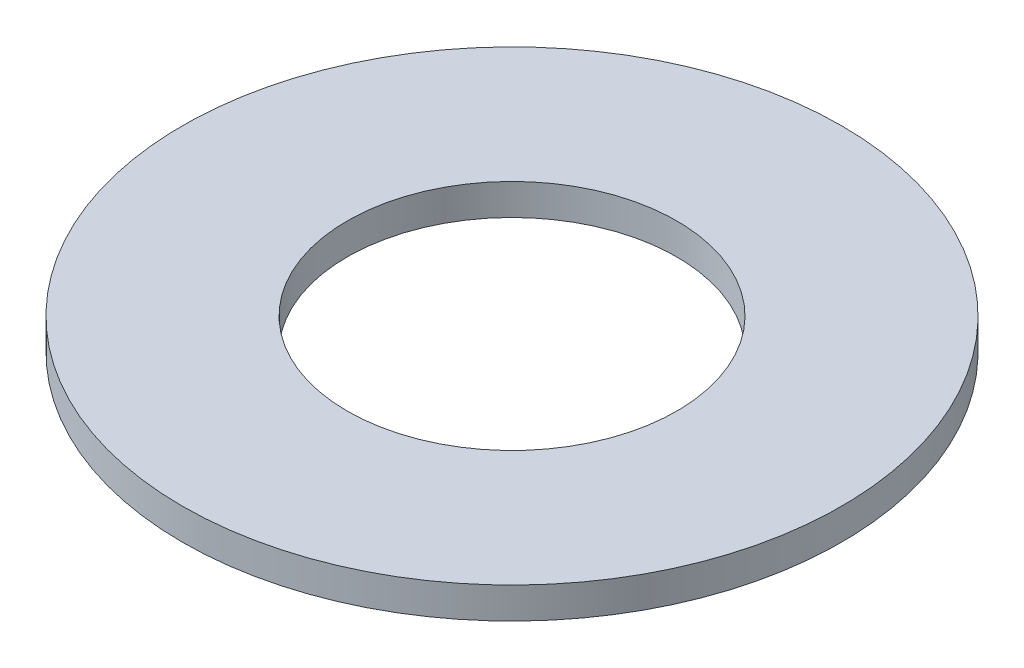
ISO-10303-21;
HEADER;
FILE_DESCRIPTION(('STEP AP214'),'2;1');
FILE_NAME('part.step','',(''),(''),'','','');
FILE_SCHEMA(('AUTOMOTIVE_DESIGN { 1 0 10303 214 1 1 1 1 }'));
ENDSEC;
DATA;
#1=APPLICATION_CONTEXT('core data for automotive mechanical design processes');
#2=APPLICATION_PROTOCOL_DEFINITION('international standard','automotive_design',2000,#1);
#3=PRODUCT_CONTEXT('',#1,'mechanical');
#4=PRODUCT('Part','Part','',(#3));
#5=PRODUCT_RELATED_PRODUCT_CATEGORY('part','',(#4));
#6=PRODUCT_DEFINITION_FORMATION('','',#4);
#7=PRODUCT_DEFINITION_CONTEXT('part definition',#1,'design');
#8=PRODUCT_DEFINITION('design','',#6,#7);
#9=PRODUCT_DEFINITION_SHAPE('','',#8);
#10=(LENGTH_UNIT() NAMED_UNIT(*) SI_UNIT(.MILLI.,.METRE.));
#11=(NAMED_UNIT(*) PLANE_ANGLE_UNIT() SI_UNIT($,.RADIAN.));
#12=(NAMED_UNIT(*) SI_UNIT($,.STERADIAN.) SOLID_ANGLE_UNIT());
#13=UNCERTAINTY_MEASURE_WITH_UNIT(LENGTH_MEASURE(1.E-05),#10,'distance_accuracy_value','');
#14=(GEOMETRIC_REPRESENTATION_CONTEXT(3) GLOBAL_UNCERTAINTY_ASSIGNED_CONTEXT((#13)) GLOBAL_UNIT_ASSIGNED_CONTEXT((#10,
#11,#12)) REPRESENTATION_CONTEXT('',''));
#15=CARTESIAN_POINT('',(0.,0.,0.));
#16=DIRECTION('',(0.,0.,1.));
#17=DIRECTION('',(1.,0.,0.));
#18=AXIS2_PLACEMENT_3D('',#15,#16,#17);
#19=CARTESIAN_POINT('',(0.,9.,0.));
#20=DIRECTION('',(0.,-1.,0.));
#21=DIRECTION('',(0.,0.,-1.));
#22=AXIS2_PLACEMENT_3D('',#19,#20,#21);
#23=CYLINDRICAL_SURFACE('',#22,95.);
#24=CARTESIAN_POINT('',(0.,9.,0.));
#25=DIRECTION('',(0.,1.,0.));
#26=DIRECTION('',(0.,0.,1.));
#27=AXIS2_PLACEMENT_3D('',#24,#25,#26);
#28=CIRCLE('',#27,95.);
#29=CARTESIAN_POINT('',(0.,9.,95.));
#30=VERTEX_POINT('',#29);
#31=EDGE_CURVE('E10',#30,#30,#28,.T.);
#32=ORIENTED_EDGE('',*,*,#31,.F.);
#33=EDGE_LOOP('',(#32));
#34=FACE_BOUND('',#33,.T.);
#35=CARTESIAN_POINT('',(0.,0.,0.));
#36=DIRECTION('',(0.,1.,0.));
#37=DIRECTION('',(0.,0.,1.));
#38=AXIS2_PLACEMENT_3D('',#35,#36,#37);
#39=CIRCLE('',#38,95.);
#40=CARTESIAN_POINT('',(0.,0.,95.));
#41=VERTEX_POINT('',#40);
#42=EDGE_CURVE('E37',#41,#41,#39,.T.);
#43=ORIENTED_EDGE('',*,*,#42,.T.);
#44=EDGE_LOOP('',(#43));
#45=FACE_BOUND('',#44,.T.);
#46=ADVANCED_FACE('F40',(#34,#45),#23,.T.);
#47=CARTESIAN_POINT('',(0.,9.,0.));
#48=DIRECTION('',(0.,1.,0.));
#49=DIRECTION('',(0.,0.,1.));
#50=AXIS2_PLACEMENT_3D('',#47,#48,#49);
#51=PLANE('',#50);
#52=CARTESIAN_POINT('',(0.,9.,0.));
#53=DIRECTION('',(0.,1.,0.));
#54=DIRECTION('',(0.,0.,1.));
#55=AXIS2_PLACEMENT_3D('',#52,#53,#54);
#56=CIRCLE('',#55,47.5);
#57=CARTESIAN_POINT('',(0.,9.,47.5));
#58=VERTEX_POINT('',#57);
#59=EDGE_CURVE('E50',#58,#58,#56,.T.);
#60=ORIENTED_EDGE('',*,*,#59,.F.);
#61=EDGE_LOOP('',(#60));
#62=FACE_BOUND('',#61,.T.);
#63=ORIENTED_EDGE('',*,*,#31,.T.);
#64=EDGE_LOOP('',(#63));
#65=FACE_BOUND('',#64,.T.);
#66=ADVANCED_FACE('F59',(#62,#65),#51,.T.);
#67=CARTESIAN_POINT('',(0.,0.,0.));
#68=DIRECTION('',(0.,1.,0.));
#69=DIRECTION('',(0.,0.,1.));
#70=AXIS2_PLACEMENT_3D('',#67,#68,#69);
#71=PLANE('',#70);
#72=CARTESIAN_POINT('',(0.,0.,0.));
#73=DIRECTION('',(0.,1.,0.));
#74=DIRECTION('',(0.,0.,1.));
#75=AXIS2_PLACEMENT_3D('',#72,#73,#74);
#76=CIRCLE('',#75,47.5);
#77=CARTESIAN_POINT('',(0.,0.,47.5));
#78=VERTEX_POINT('',#77);
#79=EDGE_CURVE('E47',#78,#78,#76,.T.);
#80=ORIENTED_EDGE('',*,*,#79,.T.);
#81=EDGE_LOOP('',(#80));
#82=FACE_BOUND('',#81,.T.);
#83=ORIENTED_EDGE('',*,*,#42,.F.);
#84=EDGE_LOOP('',(#83));
#85=FACE_BOUND('',#84,.T.);
#86=ADVANCED_FACE('F58',(#82,#85),#71,.F.);
#87=CARTESIAN_POINT('',(0.,9.,0.));
#88=DIRECTION('',(0.,-1.,0.));
#89=DIRECTION('',(0.,0.,-1.));
#90=AXIS2_PLACEMENT_3D('',#87,#88,#89);
#91=CYLINDRICAL_SURFACE('',#90,47.5);
#92=ORIENTED_EDGE('',*,*,#59,.T.);
#93=EDGE_LOOP('',(#92));
#94=FACE_BOUND('',#93,.T.);
#95=ORIENTED_EDGE('',*,*,#79,.F.);
#96=EDGE_LOOP('',(#95));
#97=FACE_BOUND('',#96,.T.);
#98=ADVANCED_FACE('F54',(#94,#97),#91,.F.);
#99=CLOSED_SHELL('',(#46,#66,#86,#98));
#100=MANIFOLD_SOLID_BREP('B2',#99);
#101=ADVANCED_BREP_SHAPE_REPRESENTATION('',(#18,#100),#14);
#102=SHAPE_DEFINITION_REPRESENTATION(#9,#101);
ENDSEC;
END-ISO-10303-21;
